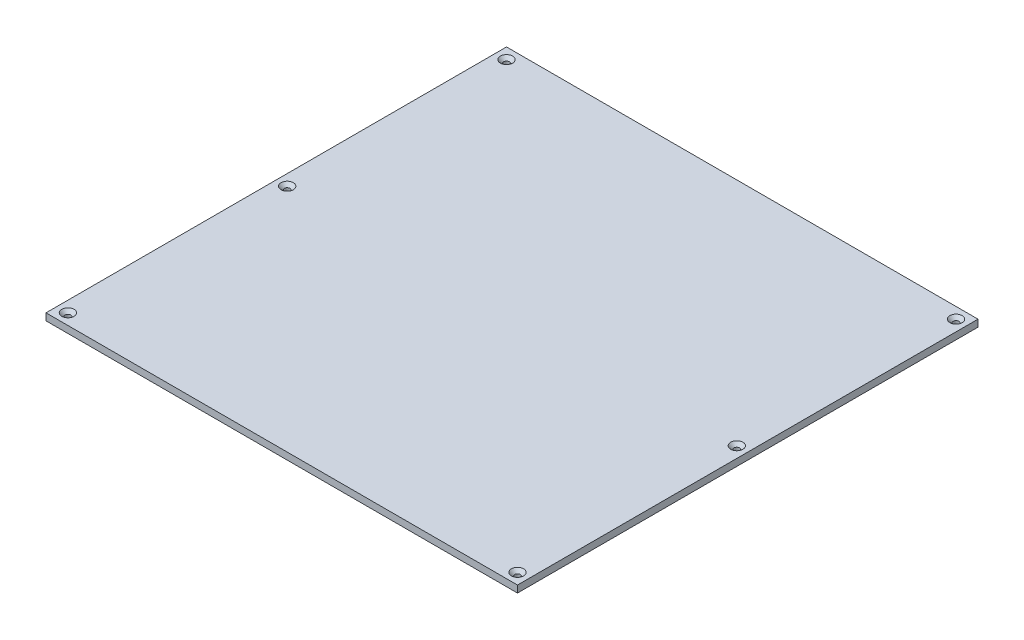
ISO-10303-21;
HEADER;
FILE_DESCRIPTION(('STEP AP214'),'2;1');
FILE_NAME('part.step','',(''),(''),'','','');
FILE_SCHEMA(('AUTOMOTIVE_DESIGN { 1 0 10303 214 1 1 1 1 }'));
ENDSEC;
DATA;
#1=APPLICATION_CONTEXT('core data for automotive mechanical design processes');
#2=APPLICATION_PROTOCOL_DEFINITION('international standard','automotive_design',2000,#1);
#3=PRODUCT_CONTEXT('',#1,'mechanical');
#4=PRODUCT('Part','Part','',(#3));
#5=PRODUCT_RELATED_PRODUCT_CATEGORY('part','',(#4));
#6=PRODUCT_DEFINITION_FORMATION('','',#4);
#7=PRODUCT_DEFINITION_CONTEXT('part definition',#1,'design');
#8=PRODUCT_DEFINITION('design','',#6,#7);
#9=PRODUCT_DEFINITION_SHAPE('','',#8);
#10=(LENGTH_UNIT() NAMED_UNIT(*) SI_UNIT(.MILLI.,.METRE.));
#11=(NAMED_UNIT(*) PLANE_ANGLE_UNIT() SI_UNIT($,.RADIAN.));
#12=(NAMED_UNIT(*) SI_UNIT($,.STERADIAN.) SOLID_ANGLE_UNIT());
#13=UNCERTAINTY_MEASURE_WITH_UNIT(LENGTH_MEASURE(1.E-05),#10,'distance_accuracy_value','');
#14=(GEOMETRIC_REPRESENTATION_CONTEXT(3) GLOBAL_UNCERTAINTY_ASSIGNED_CONTEXT((#13)) GLOBAL_UNIT_ASSIGNED_CONTEXT((#10,
#11,#12)) REPRESENTATION_CONTEXT('',''));
#15=CARTESIAN_POINT('',(0.,0.,0.));
#16=DIRECTION('',(0.,0.,1.));
#17=DIRECTION('',(1.,0.,0.));
#18=AXIS2_PLACEMENT_3D('',#15,#16,#17);
#19=CARTESIAN_POINT('',(0.,3.175,0.));
#20=DIRECTION('',(0.,-1.,0.));
#21=DIRECTION('',(0.,0.,-1.));
#22=AXIS2_PLACEMENT_3D('',#19,#20,#21);
#23=PLANE('',#22);
#24=CARTESIAN_POINT('',(-205.,3.175,0.));
#25=DIRECTION('',(0.,-1.,0.));
#26=DIRECTION('',(0.,0.,-1.));
#27=AXIS2_PLACEMENT_3D('',#24,#25,#26);
#28=CIRCLE('',#27,5.60000000000005);
#29=CARTESIAN_POINT('',(-205.,3.175,-5.60000000000005));
#30=VERTEX_POINT('',#29);
#31=EDGE_CURVE('E128',#30,#30,#28,.T.);
#32=ORIENTED_EDGE('',*,*,#31,.T.);
#33=EDGE_LOOP('',(#32));
#34=FACE_BOUND('',#33,.T.);
#35=CARTESIAN_POINT('',(205.,3.175,0.));
#36=DIRECTION('',(0.,-1.,0.));
#37=DIRECTION('',(0.,0.,-1.));
#38=AXIS2_PLACEMENT_3D('',#35,#36,#37);
#39=CIRCLE('',#38,5.60000000000005);
#40=CARTESIAN_POINT('',(205.,3.175,-5.60000000000005));
#41=VERTEX_POINT('',#40);
#42=EDGE_CURVE('E125',#41,#41,#39,.T.);
#43=ORIENTED_EDGE('',*,*,#42,.T.);
#44=EDGE_LOOP('',(#43));
#45=FACE_BOUND('',#44,.T.);
#46=CARTESIAN_POINT('',(205.,3.175,-200.));
#47=DIRECTION('',(0.,-1.,0.));
#48=DIRECTION('',(0.,0.,-1.));
#49=AXIS2_PLACEMENT_3D('',#46,#47,#48);
#50=CIRCLE('',#49,5.60000000000016);
#51=CARTESIAN_POINT('',(205.,3.175,-205.6));
#52=VERTEX_POINT('',#51);
#53=EDGE_CURVE('E122',#52,#52,#50,.T.);
#54=ORIENTED_EDGE('',*,*,#53,.T.);
#55=EDGE_LOOP('',(#54));
#56=FACE_BOUND('',#55,.T.);
#57=CARTESIAN_POINT('',(205.,3.175,200.));
#58=DIRECTION('',(0.,-1.,0.));
#59=DIRECTION('',(0.,0.,-1.));
#60=AXIS2_PLACEMENT_3D('',#57,#58,#59);
#61=CIRCLE('',#60,5.60000000000005);
#62=CARTESIAN_POINT('',(205.,3.175,194.4));
#63=VERTEX_POINT('',#62);
#64=EDGE_CURVE('E119',#63,#63,#61,.T.);
#65=ORIENTED_EDGE('',*,*,#64,.T.);
#66=EDGE_LOOP('',(#65));
#67=FACE_BOUND('',#66,.T.);
#68=CARTESIAN_POINT('',(-205.,3.175,200.));
#69=DIRECTION('',(0.,-1.,0.));
#70=DIRECTION('',(0.,0.,-1.));
#71=AXIS2_PLACEMENT_3D('',#68,#69,#70);
#72=CIRCLE('',#71,5.60000000000005);
#73=CARTESIAN_POINT('',(-205.,3.175,194.4));
#74=VERTEX_POINT('',#73);
#75=EDGE_CURVE('E116',#74,#74,#72,.T.);
#76=ORIENTED_EDGE('',*,*,#75,.T.);
#77=EDGE_LOOP('',(#76));
#78=FACE_BOUND('',#77,.T.);
#79=CARTESIAN_POINT('',(-205.,3.175,-200.));
#80=DIRECTION('',(0.,-1.,0.));
#81=DIRECTION('',(0.,0.,-1.));
#82=AXIS2_PLACEMENT_3D('',#79,#80,#81);
#83=CIRCLE('',#82,5.60000000000016);
#84=CARTESIAN_POINT('',(-205.,3.175,-205.6));
#85=VERTEX_POINT('',#84);
#86=EDGE_CURVE('E113',#85,#85,#83,.T.);
#87=ORIENTED_EDGE('',*,*,#86,.T.);
#88=EDGE_LOOP('',(#87));
#89=FACE_BOUND('',#88,.T.);
#90=DIRECTION('',(0.,0.,1.));
#91=VECTOR('',#90,1.);
#92=CARTESIAN_POINT('',(-215.,3.175,210.));
#93=LINE('',#92,#91);
#94=CARTESIAN_POINT('',(-215.,3.175,-210.));
#95=VERTEX_POINT('',#94);
#96=CARTESIAN_POINT('',(-215.,3.175,210.));
#97=VERTEX_POINT('',#96);
#98=EDGE_CURVE('E85',#95,#97,#93,.T.);
#99=ORIENTED_EDGE('',*,*,#98,.T.);
#100=DIRECTION('',(1.,0.,0.));
#101=VECTOR('',#100,1.);
#102=CARTESIAN_POINT('',(-215.,3.175,210.));
#103=LINE('',#102,#101);
#104=CARTESIAN_POINT('',(215.,3.175,210.));
#105=VERTEX_POINT('',#104);
#106=EDGE_CURVE('E81',#97,#105,#103,.T.);
#107=ORIENTED_EDGE('',*,*,#106,.T.);
#108=DIRECTION('',(0.,0.,-1.));
#109=VECTOR('',#108,1.);
#110=CARTESIAN_POINT('',(215.,3.175,210.));
#111=LINE('',#110,#109);
#112=CARTESIAN_POINT('',(215.,3.175,-210.));
#113=VERTEX_POINT('',#112);
#114=EDGE_CURVE('E83',#105,#113,#111,.T.);
#115=ORIENTED_EDGE('',*,*,#114,.T.);
#116=DIRECTION('',(-1.,0.,0.));
#117=VECTOR('',#116,1.);
#118=CARTESIAN_POINT('',(-215.,3.175,-210.));
#119=LINE('',#118,#117);
#120=EDGE_CURVE('E50',#113,#95,#119,.T.);
#121=ORIENTED_EDGE('',*,*,#120,.T.);
#122=EDGE_LOOP('',(#99,#107,#115,#121));
#123=FACE_BOUND('',#122,.T.);
#124=ADVANCED_FACE('F33',(#34,#45,#56,#67,#78,#89,#123),#23,.F.);
#125=CARTESIAN_POINT('',(0.,-3.175,0.));
#126=DIRECTION('',(0.,-1.,0.));
#127=DIRECTION('',(0.,0.,-1.));
#128=AXIS2_PLACEMENT_3D('',#125,#126,#127);
#129=PLANE('',#128);
#130=CARTESIAN_POINT('',(-205.,-3.175,0.));
#131=DIRECTION('',(0.,1.,0.));
#132=DIRECTION('',(0.,0.,1.));
#133=AXIS2_PLACEMENT_3D('',#130,#131,#132);
#134=CIRCLE('',#133,2.59999999999999);
#135=CARTESIAN_POINT('',(-205.,-3.175,2.59999999999999));
#136=VERTEX_POINT('',#135);
#137=EDGE_CURVE('E220',#136,#136,#134,.T.);
#138=ORIENTED_EDGE('',*,*,#137,.T.);
#139=EDGE_LOOP('',(#138));
#140=FACE_BOUND('',#139,.T.);
#141=CARTESIAN_POINT('',(205.,-3.175,200.));
#142=DIRECTION('',(0.,1.,0.));
#143=DIRECTION('',(0.,0.,1.));
#144=AXIS2_PLACEMENT_3D('',#141,#142,#143);
#145=CIRCLE('',#144,2.59999999999999);
#146=CARTESIAN_POINT('',(205.,-3.175,202.6));
#147=VERTEX_POINT('',#146);
#148=EDGE_CURVE('E210',#147,#147,#145,.T.);
#149=ORIENTED_EDGE('',*,*,#148,.T.);
#150=EDGE_LOOP('',(#149));
#151=FACE_BOUND('',#150,.T.);
#152=CARTESIAN_POINT('',(-205.,-3.175,-200.));
#153=DIRECTION('',(0.,1.,0.));
#154=DIRECTION('',(0.,0.,1.));
#155=AXIS2_PLACEMENT_3D('',#152,#153,#154);
#156=CIRCLE('',#155,2.59999999999999);
#157=CARTESIAN_POINT('',(-205.,-3.175,-197.4));
#158=VERTEX_POINT('',#157);
#159=EDGE_CURVE('E103',#158,#158,#156,.T.);
#160=ORIENTED_EDGE('',*,*,#159,.T.);
#161=EDGE_LOOP('',(#160));
#162=FACE_BOUND('',#161,.T.);
#163=DIRECTION('',(0.,0.,1.));
#164=VECTOR('',#163,1.);
#165=CARTESIAN_POINT('',(-215.,-3.175,210.));
#166=LINE('',#165,#164);
#167=CARTESIAN_POINT('',(-215.,-3.175,-210.));
#168=VERTEX_POINT('',#167);
#169=CARTESIAN_POINT('',(-215.,-3.175,210.));
#170=VERTEX_POINT('',#169);
#171=EDGE_CURVE('E100',#168,#170,#166,.T.);
#172=ORIENTED_EDGE('',*,*,#171,.F.);
#173=DIRECTION('',(-1.,0.,0.));
#174=VECTOR('',#173,1.);
#175=CARTESIAN_POINT('',(-215.,-3.175,-210.));
#176=LINE('',#175,#174);
#177=CARTESIAN_POINT('',(215.,-3.175,-210.));
#178=VERTEX_POINT('',#177);
#179=EDGE_CURVE('E73',#178,#168,#176,.T.);
#180=ORIENTED_EDGE('',*,*,#179,.F.);
#181=DIRECTION('',(0.,0.,-1.));
#182=VECTOR('',#181,1.);
#183=CARTESIAN_POINT('',(215.,-3.175,210.));
#184=LINE('',#183,#182);
#185=CARTESIAN_POINT('',(215.,-3.175,210.));
#186=VERTEX_POINT('',#185);
#187=EDGE_CURVE('E67',#186,#178,#184,.T.);
#188=ORIENTED_EDGE('',*,*,#187,.F.);
#189=DIRECTION('',(1.,0.,0.));
#190=VECTOR('',#189,1.);
#191=CARTESIAN_POINT('',(-215.,-3.175,210.));
#192=LINE('',#191,#190);
#193=EDGE_CURVE('E90',#170,#186,#192,.T.);
#194=ORIENTED_EDGE('',*,*,#193,.F.);
#195=EDGE_LOOP('',(#172,#180,#188,#194));
#196=FACE_BOUND('',#195,.T.);
#197=CARTESIAN_POINT('',(205.,-3.175,-200.));
#198=DIRECTION('',(0.,1.,0.));
#199=DIRECTION('',(0.,0.,1.));
#200=AXIS2_PLACEMENT_3D('',#197,#198,#199);
#201=CIRCLE('',#200,2.59999999999999);
#202=CARTESIAN_POINT('',(205.,-3.175,-197.4));
#203=VERTEX_POINT('',#202);
#204=EDGE_CURVE('E208',#203,#203,#201,.T.);
#205=ORIENTED_EDGE('',*,*,#204,.T.);
#206=EDGE_LOOP('',(#205));
#207=FACE_BOUND('',#206,.T.);
#208=CARTESIAN_POINT('',(-205.,-3.175,200.));
#209=DIRECTION('',(0.,1.,0.));
#210=DIRECTION('',(0.,0.,1.));
#211=AXIS2_PLACEMENT_3D('',#208,#209,#210);
#212=CIRCLE('',#211,2.59999999999999);
#213=CARTESIAN_POINT('',(-205.,-3.175,202.6));
#214=VERTEX_POINT('',#213);
#215=EDGE_CURVE('E215',#214,#214,#212,.T.);
#216=ORIENTED_EDGE('',*,*,#215,.T.);
#217=EDGE_LOOP('',(#216));
#218=FACE_BOUND('',#217,.T.);
#219=CARTESIAN_POINT('',(205.,-3.175,0.));
#220=DIRECTION('',(0.,1.,0.));
#221=DIRECTION('',(0.,0.,1.));
#222=AXIS2_PLACEMENT_3D('',#219,#220,#221);
#223=CIRCLE('',#222,2.59999999999999);
#224=CARTESIAN_POINT('',(205.,-3.175,2.59999999999999));
#225=VERTEX_POINT('',#224);
#226=EDGE_CURVE('E223',#225,#225,#223,.T.);
#227=ORIENTED_EDGE('',*,*,#226,.T.);
#228=EDGE_LOOP('',(#227));
#229=FACE_BOUND('',#228,.T.);
#230=ADVANCED_FACE('F159',(#140,#151,#162,#196,#207,#218,#229),#129,.T.);
#231=CARTESIAN_POINT('',(-215.,3.175,210.));
#232=DIRECTION('',(1.,0.,0.));
#233=DIRECTION('',(0.,0.,-1.));
#234=AXIS2_PLACEMENT_3D('',#231,#232,#233);
#235=PLANE('',#234);
#236=ORIENTED_EDGE('',*,*,#171,.T.);
#237=DIRECTION('',(0.,-1.,0.));
#238=VECTOR('',#237,1.);
#239=CARTESIAN_POINT('',(-215.,3.175,210.));
#240=LINE('',#239,#238);
#241=EDGE_CURVE('E91',#97,#170,#240,.T.);
#242=ORIENTED_EDGE('',*,*,#241,.F.);
#243=ORIENTED_EDGE('',*,*,#98,.F.);
#244=DIRECTION('',(0.,-1.,0.));
#245=VECTOR('',#244,1.);
#246=CARTESIAN_POINT('',(-215.,3.175,-210.));
#247=LINE('',#246,#245);
#248=EDGE_CURVE('E96',#95,#168,#247,.T.);
#249=ORIENTED_EDGE('',*,*,#248,.T.);
#250=EDGE_LOOP('',(#236,#242,#243,#249));
#251=FACE_BOUND('',#250,.T.);
#252=ADVANCED_FACE('F167',(#251),#235,.F.);
#253=CARTESIAN_POINT('',(-215.,3.175,210.));
#254=DIRECTION('',(0.,0.,-1.));
#255=DIRECTION('',(-1.,0.,0.));
#256=AXIS2_PLACEMENT_3D('',#253,#254,#255);
#257=PLANE('',#256);
#258=ORIENTED_EDGE('',*,*,#193,.T.);
#259=DIRECTION('',(0.,-1.,0.));
#260=VECTOR('',#259,1.);
#261=CARTESIAN_POINT('',(215.,3.175,210.));
#262=LINE('',#261,#260);
#263=EDGE_CURVE('E88',#105,#186,#262,.T.);
#264=ORIENTED_EDGE('',*,*,#263,.F.);
#265=ORIENTED_EDGE('',*,*,#106,.F.);
#266=ORIENTED_EDGE('',*,*,#241,.T.);
#267=EDGE_LOOP('',(#258,#264,#265,#266));
#268=FACE_BOUND('',#267,.T.);
#269=ADVANCED_FACE('F89',(#268),#257,.F.);
#270=CARTESIAN_POINT('',(215.,3.175,210.));
#271=DIRECTION('',(-1.,0.,0.));
#272=DIRECTION('',(0.,0.,1.));
#273=AXIS2_PLACEMENT_3D('',#270,#271,#272);
#274=PLANE('',#273);
#275=ORIENTED_EDGE('',*,*,#187,.T.);
#276=DIRECTION('',(0.,-1.,0.));
#277=VECTOR('',#276,1.);
#278=CARTESIAN_POINT('',(215.,3.175,-210.));
#279=LINE('',#278,#277);
#280=EDGE_CURVE('E92',#113,#178,#279,.T.);
#281=ORIENTED_EDGE('',*,*,#280,.F.);
#282=ORIENTED_EDGE('',*,*,#114,.F.);
#283=ORIENTED_EDGE('',*,*,#263,.T.);
#284=EDGE_LOOP('',(#275,#281,#282,#283));
#285=FACE_BOUND('',#284,.T.);
#286=ADVANCED_FACE('F94',(#285),#274,.F.);
#287=CARTESIAN_POINT('',(-215.,3.175,-210.));
#288=DIRECTION('',(0.,0.,1.));
#289=DIRECTION('',(1.,0.,0.));
#290=AXIS2_PLACEMENT_3D('',#287,#288,#289);
#291=PLANE('',#290);
#292=ORIENTED_EDGE('',*,*,#179,.T.);
#293=ORIENTED_EDGE('',*,*,#248,.F.);
#294=ORIENTED_EDGE('',*,*,#120,.F.);
#295=ORIENTED_EDGE('',*,*,#280,.T.);
#296=EDGE_LOOP('',(#292,#293,#294,#295));
#297=FACE_BOUND('',#296,.T.);
#298=ADVANCED_FACE('F175',(#297),#291,.F.);
#299=CARTESIAN_POINT('',(-205.,3.175,-200.));
#300=DIRECTION('',(0.,-1.,0.));
#301=DIRECTION('',(0.,0.,-1.));
#302=AXIS2_PLACEMENT_3D('',#299,#300,#301);
#303=CYLINDRICAL_SURFACE('',#302,2.59999999999999);
#304=CARTESIAN_POINT('',(-205.,0.174999999999762,-200.));
#305=DIRECTION('',(0.,-1.,0.));
#306=DIRECTION('',(0.,0.,-1.));
#307=AXIS2_PLACEMENT_3D('',#304,#305,#306);
#308=CIRCLE('',#307,2.59999999999999);
#309=CARTESIAN_POINT('',(-205.,0.174999999999762,-202.6));
#310=VERTEX_POINT('',#309);
#311=EDGE_CURVE('E11',#310,#310,#308,.F.);
#312=ORIENTED_EDGE('',*,*,#311,.T.);
#313=EDGE_LOOP('',(#312));
#314=FACE_BOUND('',#313,.T.);
#315=ORIENTED_EDGE('',*,*,#159,.F.);
#316=EDGE_LOOP('',(#315));
#317=FACE_BOUND('',#316,.T.);
#318=ADVANCED_FACE('F172',(#314,#317),#303,.F.);
#319=CARTESIAN_POINT('',(205.,3.175,-200.));
#320=DIRECTION('',(0.,-1.,0.));
#321=DIRECTION('',(0.,0.,-1.));
#322=AXIS2_PLACEMENT_3D('',#319,#320,#321);
#323=CYLINDRICAL_SURFACE('',#322,2.59999999999999);
#324=CARTESIAN_POINT('',(205.,0.174999999999762,-200.));
#325=DIRECTION('',(0.,-1.,0.));
#326=DIRECTION('',(0.,0.,-1.));
#327=AXIS2_PLACEMENT_3D('',#324,#325,#326);
#328=CIRCLE('',#327,2.59999999999999);
#329=CARTESIAN_POINT('',(205.,0.174999999999762,-202.6));
#330=VERTEX_POINT('',#329);
#331=EDGE_CURVE('E134',#330,#330,#328,.F.);
#332=ORIENTED_EDGE('',*,*,#331,.T.);
#333=EDGE_LOOP('',(#332));
#334=FACE_BOUND('',#333,.T.);
#335=ORIENTED_EDGE('',*,*,#204,.F.);
#336=EDGE_LOOP('',(#335));
#337=FACE_BOUND('',#336,.T.);
#338=ADVANCED_FACE('F202',(#334,#337),#323,.F.);
#339=CARTESIAN_POINT('',(205.,3.175,200.));
#340=DIRECTION('',(0.,-1.,0.));
#341=DIRECTION('',(0.,0.,-1.));
#342=AXIS2_PLACEMENT_3D('',#339,#340,#341);
#343=CYLINDRICAL_SURFACE('',#342,2.59999999999999);
#344=CARTESIAN_POINT('',(205.,0.174999999999928,200.));
#345=DIRECTION('',(0.,-1.,0.));
#346=DIRECTION('',(0.,0.,-1.));
#347=AXIS2_PLACEMENT_3D('',#344,#345,#346);
#348=CIRCLE('',#347,2.59999999999999);
#349=CARTESIAN_POINT('',(205.,0.174999999999928,197.4));
#350=VERTEX_POINT('',#349);
#351=EDGE_CURVE('E137',#350,#350,#348,.F.);
#352=ORIENTED_EDGE('',*,*,#351,.T.);
#353=EDGE_LOOP('',(#352));
#354=FACE_BOUND('',#353,.T.);
#355=ORIENTED_EDGE('',*,*,#148,.F.);
#356=EDGE_LOOP('',(#355));
#357=FACE_BOUND('',#356,.T.);
#358=ADVANCED_FACE('F205',(#354,#357),#343,.F.);
#359=CARTESIAN_POINT('',(-205.,3.175,200.));
#360=DIRECTION('',(0.,-1.,0.));
#361=DIRECTION('',(0.,0.,-1.));
#362=AXIS2_PLACEMENT_3D('',#359,#360,#361);
#363=CYLINDRICAL_SURFACE('',#362,2.59999999999999);
#364=CARTESIAN_POINT('',(-205.,0.174999999999928,200.));
#365=DIRECTION('',(0.,-1.,0.));
#366=DIRECTION('',(0.,0.,-1.));
#367=AXIS2_PLACEMENT_3D('',#364,#365,#366);
#368=CIRCLE('',#367,2.59999999999999);
#369=CARTESIAN_POINT('',(-205.,0.174999999999928,197.4));
#370=VERTEX_POINT('',#369);
#371=EDGE_CURVE('E42',#370,#370,#368,.F.);
#372=ORIENTED_EDGE('',*,*,#371,.T.);
#373=EDGE_LOOP('',(#372));
#374=FACE_BOUND('',#373,.T.);
#375=ORIENTED_EDGE('',*,*,#215,.F.);
#376=EDGE_LOOP('',(#375));
#377=FACE_BOUND('',#376,.T.);
#378=ADVANCED_FACE('F142',(#374,#377),#363,.F.);
#379=CARTESIAN_POINT('',(-205.,3.175,0.));
#380=DIRECTION('',(0.,-1.,0.));
#381=DIRECTION('',(0.,0.,-1.));
#382=AXIS2_PLACEMENT_3D('',#379,#380,#381);
#383=CYLINDRICAL_SURFACE('',#382,2.59999999999999);
#384=CARTESIAN_POINT('',(-205.,0.17499999999993,0.));
#385=DIRECTION('',(0.,-1.,0.));
#386=DIRECTION('',(0.,0.,-1.));
#387=AXIS2_PLACEMENT_3D('',#384,#385,#386);
#388=CIRCLE('',#387,2.59999999999999);
#389=CARTESIAN_POINT('',(-205.,0.17499999999993,-2.59999999999999));
#390=VERTEX_POINT('',#389);
#391=EDGE_CURVE('E110',#390,#390,#388,.F.);
#392=ORIENTED_EDGE('',*,*,#391,.T.);
#393=EDGE_LOOP('',(#392));
#394=FACE_BOUND('',#393,.T.);
#395=ORIENTED_EDGE('',*,*,#137,.F.);
#396=EDGE_LOOP('',(#395));
#397=FACE_BOUND('',#396,.T.);
#398=ADVANCED_FACE('F229',(#394,#397),#383,.F.);
#399=CARTESIAN_POINT('',(205.,3.175,0.));
#400=DIRECTION('',(0.,-1.,0.));
#401=DIRECTION('',(0.,0.,-1.));
#402=AXIS2_PLACEMENT_3D('',#399,#400,#401);
#403=CYLINDRICAL_SURFACE('',#402,2.59999999999999);
#404=CARTESIAN_POINT('',(205.,0.17499999999993,0.));
#405=DIRECTION('',(0.,-1.,0.));
#406=DIRECTION('',(0.,0.,-1.));
#407=AXIS2_PLACEMENT_3D('',#404,#405,#406);
#408=CIRCLE('',#407,2.59999999999999);
#409=CARTESIAN_POINT('',(205.,0.17499999999993,-2.59999999999999));
#410=VERTEX_POINT('',#409);
#411=EDGE_CURVE('E131',#410,#410,#408,.F.);
#412=ORIENTED_EDGE('',*,*,#411,.T.);
#413=EDGE_LOOP('',(#412));
#414=FACE_BOUND('',#413,.T.);
#415=ORIENTED_EDGE('',*,*,#226,.F.);
#416=EDGE_LOOP('',(#415));
#417=FACE_BOUND('',#416,.T.);
#418=ADVANCED_FACE('F189',(#414,#417),#403,.F.);
#419=CARTESIAN_POINT('',(-205.,0.17499999999993,0.));
#420=DIRECTION('',(0.,1.,0.));
#421=DIRECTION('',(0.,0.,1.));
#422=AXIS2_PLACEMENT_3D('',#419,#420,#421);
#423=CONICAL_SURFACE('',#422,2.59999999999999,0.785398163397447);
#424=ORIENTED_EDGE('',*,*,#31,.F.);
#425=EDGE_LOOP('',(#424));
#426=FACE_BOUND('',#425,.T.);
#427=ORIENTED_EDGE('',*,*,#391,.F.);
#428=EDGE_LOOP('',(#427));
#429=FACE_BOUND('',#428,.T.);
#430=ADVANCED_FACE('F185',(#426,#429),#423,.F.);
#431=CARTESIAN_POINT('',(205.,0.17499999999993,0.));
#432=DIRECTION('',(0.,1.,0.));
#433=DIRECTION('',(0.,0.,1.));
#434=AXIS2_PLACEMENT_3D('',#431,#432,#433);
#435=CONICAL_SURFACE('',#434,2.59999999999999,0.785398163397447);
#436=ORIENTED_EDGE('',*,*,#42,.F.);
#437=EDGE_LOOP('',(#436));
#438=FACE_BOUND('',#437,.T.);
#439=ORIENTED_EDGE('',*,*,#411,.F.);
#440=EDGE_LOOP('',(#439));
#441=FACE_BOUND('',#440,.T.);
#442=ADVANCED_FACE('F188',(#438,#441),#435,.F.);
#443=CARTESIAN_POINT('',(205.,0.174999999999762,-200.));
#444=DIRECTION('',(0.,1.,0.));
#445=DIRECTION('',(0.,0.,1.));
#446=AXIS2_PLACEMENT_3D('',#443,#444,#445);
#447=CONICAL_SURFACE('',#446,2.59999999999999,0.785398163397438);
#448=ORIENTED_EDGE('',*,*,#53,.F.);
#449=EDGE_LOOP('',(#448));
#450=FACE_BOUND('',#449,.T.);
#451=ORIENTED_EDGE('',*,*,#331,.F.);
#452=EDGE_LOOP('',(#451));
#453=FACE_BOUND('',#452,.T.);
#454=ADVANCED_FACE('F154',(#450,#453),#447,.F.);
#455=CARTESIAN_POINT('',(205.,0.174999999999928,200.));
#456=DIRECTION('',(0.,1.,0.));
#457=DIRECTION('',(0.,0.,1.));
#458=AXIS2_PLACEMENT_3D('',#455,#456,#457);
#459=CONICAL_SURFACE('',#458,2.59999999999999,0.785398163397447);
#460=ORIENTED_EDGE('',*,*,#64,.F.);
#461=EDGE_LOOP('',(#460));
#462=FACE_BOUND('',#461,.T.);
#463=ORIENTED_EDGE('',*,*,#351,.F.);
#464=EDGE_LOOP('',(#463));
#465=FACE_BOUND('',#464,.T.);
#466=ADVANCED_FACE('F147',(#462,#465),#459,.F.);
#467=CARTESIAN_POINT('',(-205.,0.174999999999928,200.));
#468=DIRECTION('',(0.,1.,0.));
#469=DIRECTION('',(0.,0.,1.));
#470=AXIS2_PLACEMENT_3D('',#467,#468,#469);
#471=CONICAL_SURFACE('',#470,2.59999999999999,0.785398163397447);
#472=ORIENTED_EDGE('',*,*,#75,.F.);
#473=EDGE_LOOP('',(#472));
#474=FACE_BOUND('',#473,.T.);
#475=ORIENTED_EDGE('',*,*,#371,.F.);
#476=EDGE_LOOP('',(#475));
#477=FACE_BOUND('',#476,.T.);
#478=ADVANCED_FACE('F145',(#474,#477),#471,.F.);
#479=CARTESIAN_POINT('',(-205.,0.174999999999762,-200.));
#480=DIRECTION('',(0.,1.,0.));
#481=DIRECTION('',(0.,0.,1.));
#482=AXIS2_PLACEMENT_3D('',#479,#480,#481);
#483=CONICAL_SURFACE('',#482,2.59999999999999,0.785398163397438);
#484=ORIENTED_EDGE('',*,*,#86,.F.);
#485=EDGE_LOOP('',(#484));
#486=FACE_BOUND('',#485,.T.);
#487=ORIENTED_EDGE('',*,*,#311,.F.);
#488=EDGE_LOOP('',(#487));
#489=FACE_BOUND('',#488,.T.);
#490=ADVANCED_FACE('F35',(#486,#489),#483,.F.);
#491=CLOSED_SHELL('',(#124,#230,#252,#269,#286,#298,#318,#338,#358,#378,#398,#418,#430,#442,
#454,#466,#478,#490));
#492=MANIFOLD_SOLID_BREP('B2',#491);
#493=ADVANCED_BREP_SHAPE_REPRESENTATION('',(#18,#492),#14);
#494=SHAPE_DEFINITION_REPRESENTATION(#9,#493);
ENDSEC;
END-ISO-10303-21;
